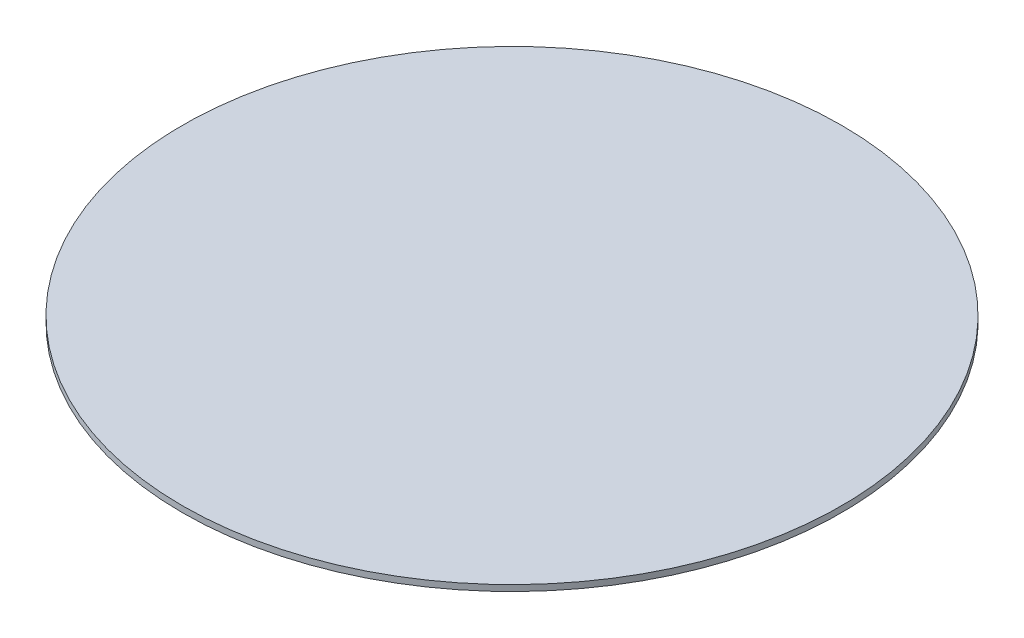
ISO-10303-21;
HEADER;
FILE_DESCRIPTION(('STEP AP214'),'2;1');
FILE_NAME('part.step','',(''),(''),'','','');
FILE_SCHEMA(('AUTOMOTIVE_DESIGN { 1 0 10303 214 1 1 1 1 }'));
ENDSEC;
DATA;
#1=APPLICATION_CONTEXT('core data for automotive mechanical design processes');
#2=APPLICATION_PROTOCOL_DEFINITION('international standard','automotive_design',2000,#1);
#3=PRODUCT_CONTEXT('',#1,'mechanical');
#4=PRODUCT('Part','Part','',(#3));
#5=PRODUCT_RELATED_PRODUCT_CATEGORY('part','',(#4));
#6=PRODUCT_DEFINITION_FORMATION('','',#4);
#7=PRODUCT_DEFINITION_CONTEXT('part definition',#1,'design');
#8=PRODUCT_DEFINITION('design','',#6,#7);
#9=PRODUCT_DEFINITION_SHAPE('','',#8);
#10=(LENGTH_UNIT() NAMED_UNIT(*) SI_UNIT(.MILLI.,.METRE.));
#11=(NAMED_UNIT(*) PLANE_ANGLE_UNIT() SI_UNIT($,.RADIAN.));
#12=(NAMED_UNIT(*) SI_UNIT($,.STERADIAN.) SOLID_ANGLE_UNIT());
#13=UNCERTAINTY_MEASURE_WITH_UNIT(LENGTH_MEASURE(1.E-05),#10,'distance_accuracy_value','');
#14=(GEOMETRIC_REPRESENTATION_CONTEXT(3) GLOBAL_UNCERTAINTY_ASSIGNED_CONTEXT((#13)) GLOBAL_UNIT_ASSIGNED_CONTEXT((#10,
#11,#12)) REPRESENTATION_CONTEXT('',''));
#15=CARTESIAN_POINT('',(0.,0.,0.));
#16=DIRECTION('',(0.,0.,1.));
#17=DIRECTION('',(1.,0.,0.));
#18=AXIS2_PLACEMENT_3D('',#15,#16,#17);
#19=CARTESIAN_POINT('',(-322.943261647424,130.198713563483,-81.536826026479));
#20=DIRECTION('',(0.,-1.,0.));
#21=DIRECTION('',(0.,0.,-1.));
#22=AXIS2_PLACEMENT_3D('',#19,#20,#21);
#23=CYLINDRICAL_SURFACE('',#22,60.);
#24=CARTESIAN_POINT('',(-322.943261647424,130.198713563483,-81.536826026479));
#25=DIRECTION('',(0.,1.,0.));
#26=DIRECTION('',(0.,0.,1.));
#27=AXIS2_PLACEMENT_3D('',#24,#25,#26);
#28=CIRCLE('',#27,60.);
#29=CARTESIAN_POINT('',(-322.943261647424,130.198713563483,-21.5368260264791));
#30=VERTEX_POINT('',#29);
#31=EDGE_CURVE('E10',#30,#30,#28,.T.);
#32=ORIENTED_EDGE('',*,*,#31,.F.);
#33=EDGE_LOOP('',(#32));
#34=FACE_BOUND('',#33,.T.);
#35=CARTESIAN_POINT('',(-322.943261647424,129.098713563483,-81.536826026479));
#36=DIRECTION('',(0.,1.,0.));
#37=DIRECTION('',(0.,0.,1.));
#38=AXIS2_PLACEMENT_3D('',#35,#36,#37);
#39=CIRCLE('',#38,60.);
#40=CARTESIAN_POINT('',(-322.943261647424,129.098713563483,-21.5368260264791));
#41=VERTEX_POINT('',#40);
#42=EDGE_CURVE('E32',#41,#41,#39,.T.);
#43=ORIENTED_EDGE('',*,*,#42,.T.);
#44=EDGE_LOOP('',(#43));
#45=FACE_BOUND('',#44,.T.);
#46=ADVANCED_FACE('F29',(#34,#45),#23,.T.);
#47=CARTESIAN_POINT('',(-322.943261647424,130.198713563483,-81.536826026479));
#48=DIRECTION('',(0.,1.,0.));
#49=DIRECTION('',(0.,0.,1.));
#50=AXIS2_PLACEMENT_3D('',#47,#48,#49);
#51=PLANE('',#50);
#52=ORIENTED_EDGE('',*,*,#31,.T.);
#53=EDGE_LOOP('',(#52));
#54=FACE_BOUND('',#53,.T.);
#55=ADVANCED_FACE('F44',(#54),#51,.T.);
#56=CARTESIAN_POINT('',(-322.943261647424,129.098713563483,-81.536826026479));
#57=DIRECTION('',(0.,1.,0.));
#58=DIRECTION('',(0.,0.,1.));
#59=AXIS2_PLACEMENT_3D('',#56,#57,#58);
#60=PLANE('',#59);
#61=ORIENTED_EDGE('',*,*,#42,.F.);
#62=EDGE_LOOP('',(#61));
#63=FACE_BOUND('',#62,.T.);
#64=ADVANCED_FACE('F42',(#63),#60,.F.);
#65=CLOSED_SHELL('',(#46,#55,#64));
#66=MANIFOLD_SOLID_BREP('B2',#65);
#67=ADVANCED_BREP_SHAPE_REPRESENTATION('',(#18,#66),#14);
#68=SHAPE_DEFINITION_REPRESENTATION(#9,#67);
ENDSEC;
END-ISO-10303-21;
